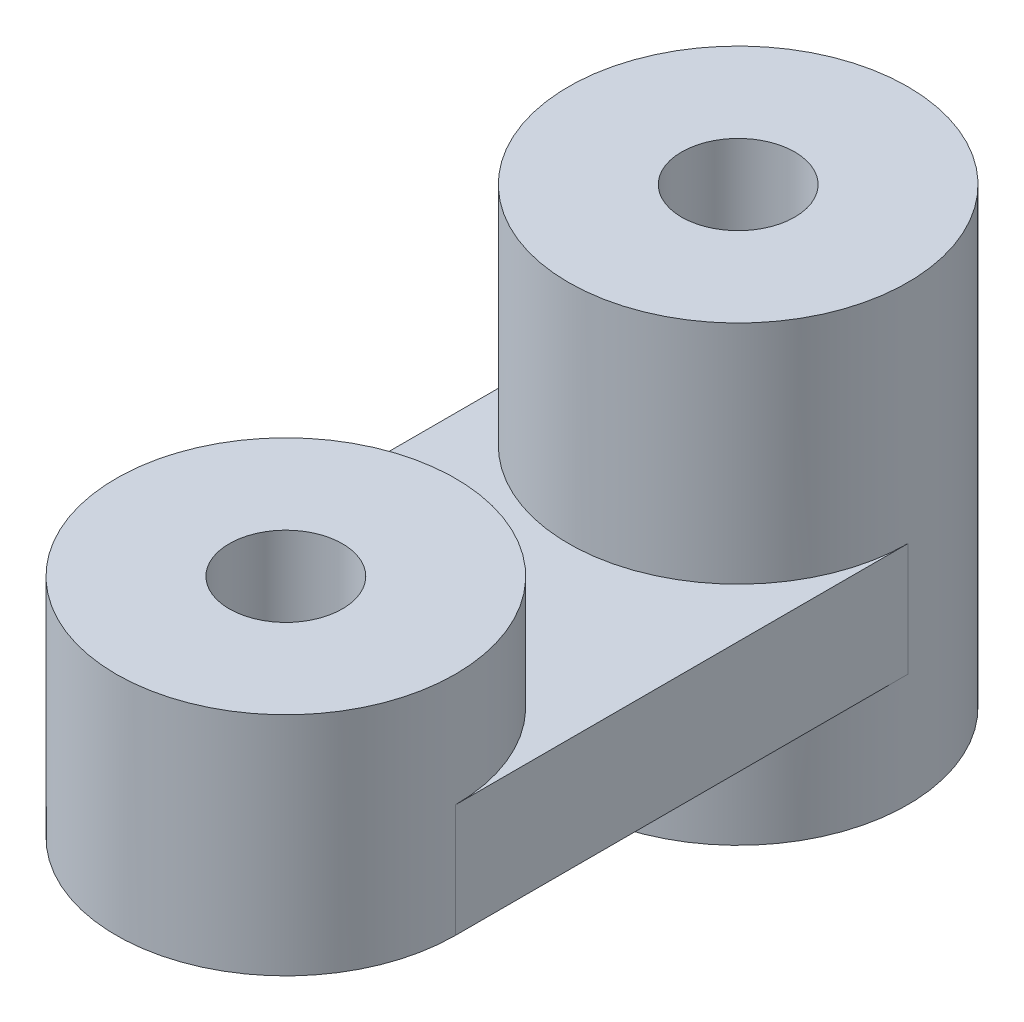
ISO-10303-21;
HEADER;
FILE_DESCRIPTION(('STEP AP214'),'2;1');
FILE_NAME('part.step','',(''),(''),'','','');
FILE_SCHEMA(('AUTOMOTIVE_DESIGN { 1 0 10303 214 1 1 1 1 }'));
ENDSEC;
DATA;
#1=APPLICATION_CONTEXT('core data for automotive mechanical design processes');
#2=APPLICATION_PROTOCOL_DEFINITION('international standard','automotive_design',2000,#1);
#3=PRODUCT_CONTEXT('',#1,'mechanical');
#4=PRODUCT('Part','Part','',(#3));
#5=PRODUCT_RELATED_PRODUCT_CATEGORY('part','',(#4));
#6=PRODUCT_DEFINITION_FORMATION('','',#4);
#7=PRODUCT_DEFINITION_CONTEXT('part definition',#1,'design');
#8=PRODUCT_DEFINITION('design','',#6,#7);
#9=PRODUCT_DEFINITION_SHAPE('','',#8);
#10=(LENGTH_UNIT() NAMED_UNIT(*) SI_UNIT(.MILLI.,.METRE.));
#11=(NAMED_UNIT(*) PLANE_ANGLE_UNIT() SI_UNIT($,.RADIAN.));
#12=(NAMED_UNIT(*) SI_UNIT($,.STERADIAN.) SOLID_ANGLE_UNIT());
#13=UNCERTAINTY_MEASURE_WITH_UNIT(LENGTH_MEASURE(1.E-05),#10,'distance_accuracy_value','');
#14=(GEOMETRIC_REPRESENTATION_CONTEXT(3) GLOBAL_UNCERTAINTY_ASSIGNED_CONTEXT((#13)) GLOBAL_UNIT_ASSIGNED_CONTEXT((#10,
#11,#12)) REPRESENTATION_CONTEXT('',''));
#15=CARTESIAN_POINT('',(0.,0.,0.));
#16=DIRECTION('',(0.,0.,1.));
#17=DIRECTION('',(1.,0.,0.));
#18=AXIS2_PLACEMENT_3D('',#15,#16,#17);
#19=CARTESIAN_POINT('',(0.,5.,7.5));
#20=DIRECTION('',(0.,-1.,0.));
#21=DIRECTION('',(0.,0.,-1.));
#22=AXIS2_PLACEMENT_3D('',#19,#20,#21);
#23=PLANE('',#22);
#24=CARTESIAN_POINT('',(0.,5.,-12.5));
#25=DIRECTION('',(0.,1.,0.));
#26=DIRECTION('',(0.,0.,1.));
#27=AXIS2_PLACEMENT_3D('',#24,#25,#26);
#28=CIRCLE('',#27,7.5);
#29=CARTESIAN_POINT('',(-7.5,5.,-12.5));
#30=VERTEX_POINT('',#29);
#31=CARTESIAN_POINT('',(7.5,5.,-12.5));
#32=VERTEX_POINT('',#31);
#33=EDGE_CURVE('E105',#30,#32,#28,.T.);
#34=ORIENTED_EDGE('',*,*,#33,.F.);
#35=DIRECTION('',(0.,0.,1.));
#36=VECTOR('',#35,1.);
#37=CARTESIAN_POINT('',(-7.5,5.,7.5));
#38=LINE('',#37,#36);
#39=CARTESIAN_POINT('',(-7.5,5.,7.5));
#40=VERTEX_POINT('',#39);
#41=EDGE_CURVE('E50',#30,#40,#38,.T.);
#42=ORIENTED_EDGE('',*,*,#41,.T.);
#43=CARTESIAN_POINT('',(0.,5.,7.5));
#44=DIRECTION('',(0.,1.,0.));
#45=DIRECTION('',(0.,0.,1.));
#46=AXIS2_PLACEMENT_3D('',#43,#44,#45);
#47=CIRCLE('',#46,7.5);
#48=CARTESIAN_POINT('',(7.5,5.,7.5));
#49=VERTEX_POINT('',#48);
#50=EDGE_CURVE('E86',#49,#40,#47,.T.);
#51=ORIENTED_EDGE('',*,*,#50,.F.);
#52=DIRECTION('',(0.,0.,-1.));
#53=VECTOR('',#52,1.);
#54=CARTESIAN_POINT('',(7.5,5.,7.5));
#55=LINE('',#54,#53);
#56=EDGE_CURVE('E78',#49,#32,#55,.T.);
#57=ORIENTED_EDGE('',*,*,#56,.T.);
#58=EDGE_LOOP('',(#34,#42,#51,#57));
#59=FACE_BOUND('',#58,.T.);
#60=ADVANCED_FACE('F33',(#59),#23,.F.);
#61=CARTESIAN_POINT('',(0.,0.,7.5));
#62=DIRECTION('',(0.,-1.,0.));
#63=DIRECTION('',(0.,0.,-1.));
#64=AXIS2_PLACEMENT_3D('',#61,#62,#63);
#65=PLANE('',#64);
#66=CARTESIAN_POINT('',(0.,0.,-12.5));
#67=DIRECTION('',(0.,-1.,0.));
#68=DIRECTION('',(0.,0.,-1.));
#69=AXIS2_PLACEMENT_3D('',#66,#67,#68);
#70=CIRCLE('',#69,7.5);
#71=CARTESIAN_POINT('',(7.5,0.,-12.5));
#72=VERTEX_POINT('',#71);
#73=CARTESIAN_POINT('',(-7.5,0.,-12.5));
#74=VERTEX_POINT('',#73);
#75=EDGE_CURVE('E65',#72,#74,#70,.T.);
#76=ORIENTED_EDGE('',*,*,#75,.F.);
#77=DIRECTION('',(0.,0.,-1.));
#78=VECTOR('',#77,1.);
#79=CARTESIAN_POINT('',(7.5,0.,7.5));
#80=LINE('',#79,#78);
#81=CARTESIAN_POINT('',(7.5,0.,7.5));
#82=VERTEX_POINT('',#81);
#83=EDGE_CURVE('E79',#82,#72,#80,.T.);
#84=ORIENTED_EDGE('',*,*,#83,.F.);
#85=CARTESIAN_POINT('',(0.,0.,7.5));
#86=DIRECTION('',(0.,1.,0.));
#87=DIRECTION('',(0.,0.,-1.));
#88=AXIS2_PLACEMENT_3D('',#85,#86,#87);
#89=CIRCLE('',#88,7.5);
#90=CARTESIAN_POINT('',(-7.5,0.,7.5));
#91=VERTEX_POINT('',#90);
#92=EDGE_CURVE('E85',#91,#82,#89,.T.);
#93=ORIENTED_EDGE('',*,*,#92,.F.);
#94=DIRECTION('',(0.,0.,1.));
#95=VECTOR('',#94,1.);
#96=CARTESIAN_POINT('',(-7.5,0.,7.5));
#97=LINE('',#96,#95);
#98=EDGE_CURVE('E70',#74,#91,#97,.T.);
#99=ORIENTED_EDGE('',*,*,#98,.F.);
#100=EDGE_LOOP('',(#76,#84,#93,#99));
#101=FACE_BOUND('',#100,.T.);
#102=CARTESIAN_POINT('',(0.,0.,7.5));
#103=DIRECTION('',(0.,1.,0.));
#104=DIRECTION('',(0.,0.,1.));
#105=AXIS2_PLACEMENT_3D('',#102,#103,#104);
#106=CIRCLE('',#105,2.5);
#107=CARTESIAN_POINT('',(0.,0.,10.));
#108=VERTEX_POINT('',#107);
#109=EDGE_CURVE('E91',#108,#108,#106,.T.);
#110=ORIENTED_EDGE('',*,*,#109,.T.);
#111=EDGE_LOOP('',(#110));
#112=FACE_BOUND('',#111,.T.);
#113=ADVANCED_FACE('F88',(#101,#112),#65,.T.);
#114=CARTESIAN_POINT('',(0.,5.,7.5));
#115=DIRECTION('',(0.,-1.,0.));
#116=DIRECTION('',(0.,0.,-1.));
#117=AXIS2_PLACEMENT_3D('',#114,#115,#116);
#118=CYLINDRICAL_SURFACE('',#117,7.5);
#119=ORIENTED_EDGE('',*,*,#92,.T.);
#120=DIRECTION('',(0.,-1.,0.));
#121=VECTOR('',#120,1.);
#122=CARTESIAN_POINT('',(7.5,5.,7.5));
#123=LINE('',#122,#121);
#124=EDGE_CURVE('E11',#49,#82,#123,.T.);
#125=ORIENTED_EDGE('',*,*,#124,.F.);
#126=ORIENTED_EDGE('',*,*,#50,.T.);
#127=DIRECTION('',(0.,-1.,0.));
#128=VECTOR('',#127,1.);
#129=CARTESIAN_POINT('',(-7.5,5.,7.5));
#130=LINE('',#129,#128);
#131=EDGE_CURVE('E73',#40,#91,#130,.T.);
#132=ORIENTED_EDGE('',*,*,#131,.T.);
#133=EDGE_LOOP('',(#119,#125,#126,#132));
#134=FACE_BOUND('',#133,.T.);
#135=CARTESIAN_POINT('',(0.,10.,7.5));
#136=DIRECTION('',(0.,1.,0.));
#137=DIRECTION('',(0.,0.,1.));
#138=AXIS2_PLACEMENT_3D('',#135,#136,#137);
#139=CIRCLE('',#138,7.5);
#140=CARTESIAN_POINT('',(0.,10.,15.));
#141=VERTEX_POINT('',#140);
#142=EDGE_CURVE('E95',#141,#141,#139,.T.);
#143=ORIENTED_EDGE('',*,*,#142,.F.);
#144=EDGE_LOOP('',(#143));
#145=FACE_BOUND('',#144,.T.);
#146=ADVANCED_FACE('F35',(#134,#145),#118,.T.);
#147=CARTESIAN_POINT('',(7.5,5.,7.5));
#148=DIRECTION('',(-1.,0.,0.));
#149=DIRECTION('',(0.,0.,1.));
#150=AXIS2_PLACEMENT_3D('',#147,#148,#149);
#151=PLANE('',#150);
#152=ORIENTED_EDGE('',*,*,#83,.T.);
#153=DIRECTION('',(0.,-1.,0.));
#154=VECTOR('',#153,1.);
#155=CARTESIAN_POINT('',(7.5,5.,-12.5));
#156=LINE('',#155,#154);
#157=EDGE_CURVE('E42',#32,#72,#156,.T.);
#158=ORIENTED_EDGE('',*,*,#157,.F.);
#159=ORIENTED_EDGE('',*,*,#56,.F.);
#160=ORIENTED_EDGE('',*,*,#124,.T.);
#161=EDGE_LOOP('',(#152,#158,#159,#160));
#162=FACE_BOUND('',#161,.T.);
#163=ADVANCED_FACE('F110',(#162),#151,.F.);
#164=CARTESIAN_POINT('',(0.,5.,-12.5));
#165=DIRECTION('',(0.,-1.,0.));
#166=DIRECTION('',(0.,0.,-1.));
#167=AXIS2_PLACEMENT_3D('',#164,#165,#166);
#168=CYLINDRICAL_SURFACE('',#167,7.5);
#169=ORIENTED_EDGE('',*,*,#157,.T.);
#170=ORIENTED_EDGE('',*,*,#75,.T.);
#171=DIRECTION('',(0.,-1.,0.));
#172=VECTOR('',#171,1.);
#173=CARTESIAN_POINT('',(-7.5,5.,-12.5));
#174=LINE('',#173,#172);
#175=EDGE_CURVE('E75',#30,#74,#174,.T.);
#176=ORIENTED_EDGE('',*,*,#175,.F.);
#177=ORIENTED_EDGE('',*,*,#33,.T.);
#178=EDGE_LOOP('',(#169,#170,#176,#177));
#179=FACE_BOUND('',#178,.T.);
#180=CARTESIAN_POINT('',(0.,15.,-12.5));
#181=DIRECTION('',(0.,1.,0.));
#182=DIRECTION('',(0.,0.,1.));
#183=AXIS2_PLACEMENT_3D('',#180,#181,#182);
#184=CIRCLE('',#183,7.5);
#185=CARTESIAN_POINT('',(0.,15.,-5.));
#186=VERTEX_POINT('',#185);
#187=EDGE_CURVE('E112',#186,#186,#184,.T.);
#188=ORIENTED_EDGE('',*,*,#187,.F.);
#189=EDGE_LOOP('',(#188));
#190=FACE_BOUND('',#189,.T.);
#191=CARTESIAN_POINT('',(0.,-5.,-12.5));
#192=DIRECTION('',(0.,-1.,0.));
#193=DIRECTION('',(0.,0.,-1.));
#194=AXIS2_PLACEMENT_3D('',#191,#192,#193);
#195=CIRCLE('',#194,7.5);
#196=CARTESIAN_POINT('',(0.,-5.,-20.));
#197=VERTEX_POINT('',#196);
#198=EDGE_CURVE('E119',#197,#197,#195,.T.);
#199=ORIENTED_EDGE('',*,*,#198,.F.);
#200=EDGE_LOOP('',(#199));
#201=FACE_BOUND('',#200,.T.);
#202=ADVANCED_FACE('F103',(#179,#190,#201),#168,.T.);
#203=CARTESIAN_POINT('',(-7.5,5.,7.5));
#204=DIRECTION('',(1.,0.,0.));
#205=DIRECTION('',(0.,0.,-1.));
#206=AXIS2_PLACEMENT_3D('',#203,#204,#205);
#207=PLANE('',#206);
#208=ORIENTED_EDGE('',*,*,#98,.T.);
#209=ORIENTED_EDGE('',*,*,#131,.F.);
#210=ORIENTED_EDGE('',*,*,#41,.F.);
#211=ORIENTED_EDGE('',*,*,#175,.T.);
#212=EDGE_LOOP('',(#208,#209,#210,#211));
#213=FACE_BOUND('',#212,.T.);
#214=ADVANCED_FACE('F72',(#213),#207,.F.);
#215=CARTESIAN_POINT('',(0.,5.,7.5));
#216=DIRECTION('',(0.,-1.,0.));
#217=DIRECTION('',(0.,0.,-1.));
#218=AXIS2_PLACEMENT_3D('',#215,#216,#217);
#219=CYLINDRICAL_SURFACE('',#218,2.5);
#220=ORIENTED_EDGE('',*,*,#109,.F.);
#221=EDGE_LOOP('',(#220));
#222=FACE_BOUND('',#221,.T.);
#223=CARTESIAN_POINT('',(0.,10.,7.5));
#224=DIRECTION('',(0.,1.,0.));
#225=DIRECTION('',(0.,0.,1.));
#226=AXIS2_PLACEMENT_3D('',#223,#224,#225);
#227=CIRCLE('',#226,2.5);
#228=CARTESIAN_POINT('',(0.,10.,10.));
#229=VERTEX_POINT('',#228);
#230=EDGE_CURVE('E116',#229,#229,#227,.T.);
#231=ORIENTED_EDGE('',*,*,#230,.T.);
#232=EDGE_LOOP('',(#231));
#233=FACE_BOUND('',#232,.T.);
#234=ADVANCED_FACE('F141',(#222,#233),#219,.F.);
#235=CARTESIAN_POINT('',(0.,5.,-12.5));
#236=DIRECTION('',(0.,-1.,0.));
#237=DIRECTION('',(0.,0.,-1.));
#238=AXIS2_PLACEMENT_3D('',#235,#236,#237);
#239=CYLINDRICAL_SURFACE('',#238,2.5);
#240=CARTESIAN_POINT('',(0.,15.,-12.5));
#241=DIRECTION('',(0.,1.,0.));
#242=DIRECTION('',(0.,0.,1.));
#243=AXIS2_PLACEMENT_3D('',#240,#241,#242);
#244=CIRCLE('',#243,2.5);
#245=CARTESIAN_POINT('',(0.,15.,-10.));
#246=VERTEX_POINT('',#245);
#247=EDGE_CURVE('E113',#246,#246,#244,.T.);
#248=ORIENTED_EDGE('',*,*,#247,.T.);
#249=EDGE_LOOP('',(#248));
#250=FACE_BOUND('',#249,.T.);
#251=CARTESIAN_POINT('',(0.,-5.,-12.5));
#252=DIRECTION('',(0.,-1.,0.));
#253=DIRECTION('',(0.,0.,-1.));
#254=AXIS2_PLACEMENT_3D('',#251,#252,#253);
#255=CIRCLE('',#254,2.5);
#256=CARTESIAN_POINT('',(0.,-5.,-15.));
#257=VERTEX_POINT('',#256);
#258=EDGE_CURVE('E247',#257,#257,#255,.T.);
#259=ORIENTED_EDGE('',*,*,#258,.T.);
#260=EDGE_LOOP('',(#259));
#261=FACE_BOUND('',#260,.T.);
#262=ADVANCED_FACE('F162',(#250,#261),#239,.F.);
#263=CARTESIAN_POINT('',(0.,10.,7.5));
#264=DIRECTION('',(0.,1.,0.));
#265=DIRECTION('',(0.,0.,1.));
#266=AXIS2_PLACEMENT_3D('',#263,#264,#265);
#267=PLANE('',#266);
#268=ORIENTED_EDGE('',*,*,#142,.T.);
#269=EDGE_LOOP('',(#268));
#270=FACE_BOUND('',#269,.T.);
#271=ORIENTED_EDGE('',*,*,#230,.F.);
#272=EDGE_LOOP('',(#271));
#273=FACE_BOUND('',#272,.T.);
#274=ADVANCED_FACE('F128',(#270,#273),#267,.T.);
#275=CARTESIAN_POINT('',(0.,15.,-12.5));
#276=DIRECTION('',(0.,1.,0.));
#277=DIRECTION('',(0.,0.,1.));
#278=AXIS2_PLACEMENT_3D('',#275,#276,#277);
#279=PLANE('',#278);
#280=ORIENTED_EDGE('',*,*,#187,.T.);
#281=EDGE_LOOP('',(#280));
#282=FACE_BOUND('',#281,.T.);
#283=ORIENTED_EDGE('',*,*,#247,.F.);
#284=EDGE_LOOP('',(#283));
#285=FACE_BOUND('',#284,.T.);
#286=ADVANCED_FACE('F175',(#282,#285),#279,.T.);
#287=CARTESIAN_POINT('',(0.,-5.,-12.5));
#288=DIRECTION('',(0.,-1.,0.));
#289=DIRECTION('',(0.,0.,-1.));
#290=AXIS2_PLACEMENT_3D('',#287,#288,#289);
#291=PLANE('',#290);
#292=ORIENTED_EDGE('',*,*,#198,.T.);
#293=EDGE_LOOP('',(#292));
#294=FACE_BOUND('',#293,.T.);
#295=ORIENTED_EDGE('',*,*,#258,.F.);
#296=EDGE_LOOP('',(#295));
#297=FACE_BOUND('',#296,.T.);
#298=ADVANCED_FACE('F182',(#294,#297),#291,.T.);
#299=CLOSED_SHELL('',(#60,#113,#146,#163,#202,#214,#234,#262,#274,#286,#298));
#300=MANIFOLD_SOLID_BREP('B2',#299);
#301=ADVANCED_BREP_SHAPE_REPRESENTATION('',(#18,#300),#14);
#302=SHAPE_DEFINITION_REPRESENTATION(#9,#301);
ENDSEC;
END-ISO-10303-21;
